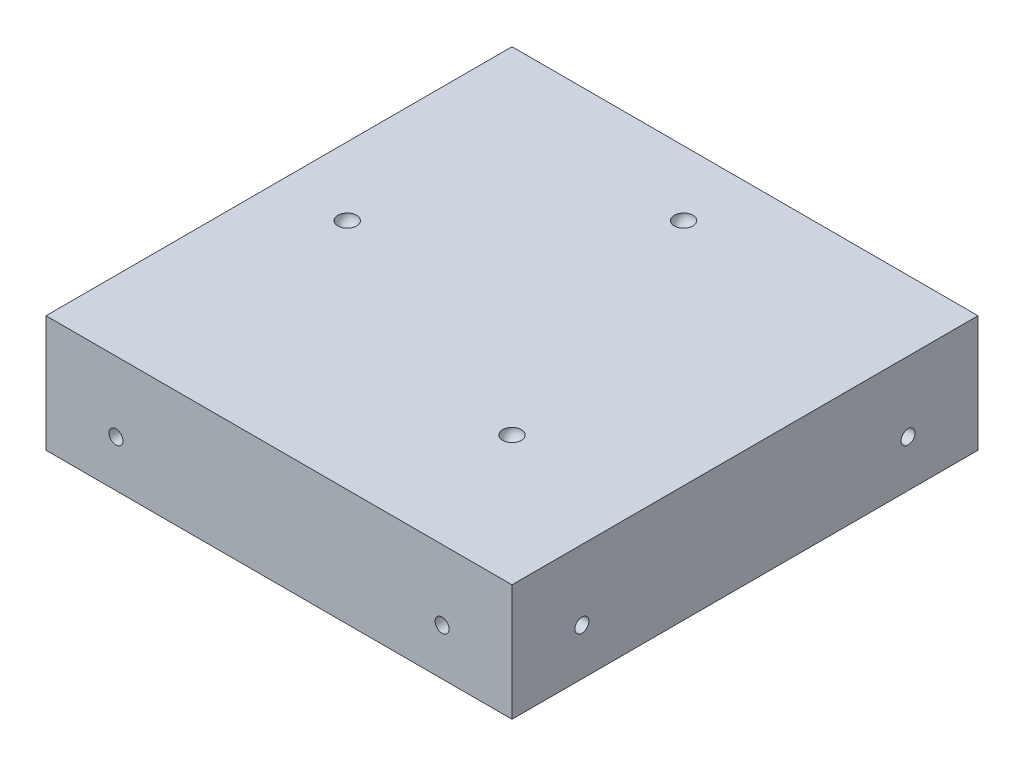
ISO-10303-21;
HEADER;
FILE_DESCRIPTION(('STEP AP214'),'2;1');
FILE_NAME('part.step','',(''),(''),'','','');
FILE_SCHEMA(('AUTOMOTIVE_DESIGN { 1 0 10303 214 1 1 1 1 }'));
ENDSEC;
DATA;
#1=APPLICATION_CONTEXT('core data for automotive mechanical design processes');
#2=APPLICATION_PROTOCOL_DEFINITION('international standard','automotive_design',2000,#1);
#3=PRODUCT_CONTEXT('',#1,'mechanical');
#4=PRODUCT('Part','Part','',(#3));
#5=PRODUCT_RELATED_PRODUCT_CATEGORY('part','',(#4));
#6=PRODUCT_DEFINITION_FORMATION('','',#4);
#7=PRODUCT_DEFINITION_CONTEXT('part definition',#1,'design');
#8=PRODUCT_DEFINITION('design','',#6,#7);
#9=PRODUCT_DEFINITION_SHAPE('','',#8);
#10=(LENGTH_UNIT() NAMED_UNIT(*) SI_UNIT(.MILLI.,.METRE.));
#11=(NAMED_UNIT(*) PLANE_ANGLE_UNIT() SI_UNIT($,.RADIAN.));
#12=(NAMED_UNIT(*) SI_UNIT($,.STERADIAN.) SOLID_ANGLE_UNIT());
#13=UNCERTAINTY_MEASURE_WITH_UNIT(LENGTH_MEASURE(1.E-05),#10,'distance_accuracy_value','');
#14=(GEOMETRIC_REPRESENTATION_CONTEXT(3) GLOBAL_UNCERTAINTY_ASSIGNED_CONTEXT((#13)) GLOBAL_UNIT_ASSIGNED_CONTEXT((#10,
#11,#12)) REPRESENTATION_CONTEXT('',''));
#15=CARTESIAN_POINT('',(0.,0.,0.));
#16=DIRECTION('',(0.,0.,1.));
#17=DIRECTION('',(1.,0.,0.));
#18=AXIS2_PLACEMENT_3D('',#15,#16,#17);
#19=CARTESIAN_POINT('',(50.,25.,-50.));
#20=DIRECTION('',(-1.,0.,0.));
#21=DIRECTION('',(0.,0.,1.));
#22=AXIS2_PLACEMENT_3D('',#19,#20,#21);
#23=PLANE('',#22);
#24=CARTESIAN_POINT('',(50.,10.,-35.));
#25=DIRECTION('',(1.,0.,0.));
#26=DIRECTION('',(0.,0.,-1.));
#27=AXIS2_PLACEMENT_3D('',#24,#25,#26);
#28=CIRCLE('',#27,1.5);
#29=CARTESIAN_POINT('',(50.,10.,-36.5));
#30=VERTEX_POINT('',#29);
#31=EDGE_CURVE('E140',#30,#30,#28,.T.);
#32=ORIENTED_EDGE('',*,*,#31,.F.);
#33=EDGE_LOOP('',(#32));
#34=FACE_BOUND('',#33,.T.);
#35=CARTESIAN_POINT('',(50.,10.,35.));
#36=DIRECTION('',(1.,0.,0.));
#37=DIRECTION('',(0.,0.,-1.));
#38=AXIS2_PLACEMENT_3D('',#35,#36,#37);
#39=CIRCLE('',#38,1.5);
#40=CARTESIAN_POINT('',(50.,10.,33.5));
#41=VERTEX_POINT('',#40);
#42=EDGE_CURVE('E134',#41,#41,#39,.T.);
#43=ORIENTED_EDGE('',*,*,#42,.F.);
#44=EDGE_LOOP('',(#43));
#45=FACE_BOUND('',#44,.T.);
#46=DIRECTION('',(0.,0.,-1.));
#47=VECTOR('',#46,1.);
#48=CARTESIAN_POINT('',(50.,0.,-50.));
#49=LINE('',#48,#47);
#50=CARTESIAN_POINT('',(50.,0.,50.));
#51=VERTEX_POINT('',#50);
#52=CARTESIAN_POINT('',(50.,0.,-50.));
#53=VERTEX_POINT('',#52);
#54=EDGE_CURVE('E101',#51,#53,#49,.T.);
#55=ORIENTED_EDGE('',*,*,#54,.T.);
#56=DIRECTION('',(0.,-1.,0.));
#57=VECTOR('',#56,1.);
#58=CARTESIAN_POINT('',(50.,25.,-50.));
#59=LINE('',#58,#57);
#60=CARTESIAN_POINT('',(50.,25.,-50.));
#61=VERTEX_POINT('',#60);
#62=EDGE_CURVE('E11',#61,#53,#59,.T.);
#63=ORIENTED_EDGE('',*,*,#62,.F.);
#64=DIRECTION('',(0.,0.,-1.));
#65=VECTOR('',#64,1.);
#66=CARTESIAN_POINT('',(50.,25.,-50.));
#67=LINE('',#66,#65);
#68=CARTESIAN_POINT('',(50.,25.,50.));
#69=VERTEX_POINT('',#68);
#70=EDGE_CURVE('E88',#69,#61,#67,.T.);
#71=ORIENTED_EDGE('',*,*,#70,.F.);
#72=DIRECTION('',(0.,-1.,0.));
#73=VECTOR('',#72,1.);
#74=CARTESIAN_POINT('',(50.,25.,50.));
#75=LINE('',#74,#73);
#76=EDGE_CURVE('E97',#69,#51,#75,.T.);
#77=ORIENTED_EDGE('',*,*,#76,.T.);
#78=EDGE_LOOP('',(#55,#63,#71,#77));
#79=FACE_BOUND('',#78,.T.);
#80=ADVANCED_FACE('F35',(#34,#45,#79),#23,.F.);
#81=CARTESIAN_POINT('',(-50.,25.,-50.));
#82=DIRECTION('',(0.,0.,1.));
#83=DIRECTION('',(1.,0.,0.));
#84=AXIS2_PLACEMENT_3D('',#81,#82,#83);
#85=PLANE('',#84);
#86=CARTESIAN_POINT('',(-35.,10.,-50.));
#87=DIRECTION('',(0.,0.,-1.));
#88=DIRECTION('',(-1.,0.,0.));
#89=AXIS2_PLACEMENT_3D('',#86,#87,#88);
#90=CIRCLE('',#89,1.5);
#91=CARTESIAN_POINT('',(-36.5,10.,-50.));
#92=VERTEX_POINT('',#91);
#93=EDGE_CURVE('E152',#92,#92,#90,.T.);
#94=ORIENTED_EDGE('',*,*,#93,.F.);
#95=EDGE_LOOP('',(#94));
#96=FACE_BOUND('',#95,.T.);
#97=CARTESIAN_POINT('',(35.,10.,-50.));
#98=DIRECTION('',(0.,0.,-1.));
#99=DIRECTION('',(-1.,0.,0.));
#100=AXIS2_PLACEMENT_3D('',#97,#98,#99);
#101=CIRCLE('',#100,1.5);
#102=CARTESIAN_POINT('',(33.5,10.,-50.));
#103=VERTEX_POINT('',#102);
#104=EDGE_CURVE('E146',#103,#103,#101,.T.);
#105=ORIENTED_EDGE('',*,*,#104,.F.);
#106=EDGE_LOOP('',(#105));
#107=FACE_BOUND('',#106,.T.);
#108=DIRECTION('',(-1.,0.,0.));
#109=VECTOR('',#108,1.);
#110=CARTESIAN_POINT('',(-50.,0.,-50.));
#111=LINE('',#110,#109);
#112=CARTESIAN_POINT('',(-50.,0.,-50.));
#113=VERTEX_POINT('',#112);
#114=EDGE_CURVE('E92',#53,#113,#111,.T.);
#115=ORIENTED_EDGE('',*,*,#114,.T.);
#116=DIRECTION('',(0.,-1.,0.));
#117=VECTOR('',#116,1.);
#118=CARTESIAN_POINT('',(-50.,25.,-50.));
#119=LINE('',#118,#117);
#120=CARTESIAN_POINT('',(-50.,25.,-50.));
#121=VERTEX_POINT('',#120);
#122=EDGE_CURVE('E44',#121,#113,#119,.T.);
#123=ORIENTED_EDGE('',*,*,#122,.F.);
#124=DIRECTION('',(-1.,0.,0.));
#125=VECTOR('',#124,1.);
#126=CARTESIAN_POINT('',(-50.,25.,-50.));
#127=LINE('',#126,#125);
#128=EDGE_CURVE('E83',#61,#121,#127,.T.);
#129=ORIENTED_EDGE('',*,*,#128,.F.);
#130=ORIENTED_EDGE('',*,*,#62,.T.);
#131=EDGE_LOOP('',(#115,#123,#129,#130));
#132=FACE_BOUND('',#131,.T.);
#133=ADVANCED_FACE('F91',(#96,#107,#132),#85,.F.);
#134=CARTESIAN_POINT('',(-50.,25.,-50.));
#135=DIRECTION('',(1.,0.,0.));
#136=DIRECTION('',(0.,0.,-1.));
#137=AXIS2_PLACEMENT_3D('',#134,#135,#136);
#138=PLANE('',#137);
#139=CARTESIAN_POINT('',(-50.,10.,35.));
#140=DIRECTION('',(-1.,0.,0.));
#141=DIRECTION('',(0.,0.,1.));
#142=AXIS2_PLACEMENT_3D('',#139,#140,#141);
#143=CIRCLE('',#142,1.5);
#144=CARTESIAN_POINT('',(-50.,10.,36.5));
#145=VERTEX_POINT('',#144);
#146=EDGE_CURVE('E164',#145,#145,#143,.T.);
#147=ORIENTED_EDGE('',*,*,#146,.F.);
#148=EDGE_LOOP('',(#147));
#149=FACE_BOUND('',#148,.T.);
#150=CARTESIAN_POINT('',(-50.,10.,-35.));
#151=DIRECTION('',(-1.,0.,0.));
#152=DIRECTION('',(0.,0.,1.));
#153=AXIS2_PLACEMENT_3D('',#150,#151,#152);
#154=CIRCLE('',#153,1.5);
#155=CARTESIAN_POINT('',(-50.,10.,-33.5));
#156=VERTEX_POINT('',#155);
#157=EDGE_CURVE('E158',#156,#156,#154,.T.);
#158=ORIENTED_EDGE('',*,*,#157,.F.);
#159=EDGE_LOOP('',(#158));
#160=FACE_BOUND('',#159,.T.);
#161=DIRECTION('',(0.,0.,1.));
#162=VECTOR('',#161,1.);
#163=CARTESIAN_POINT('',(-50.,0.,-50.));
#164=LINE('',#163,#162);
#165=CARTESIAN_POINT('',(-50.,0.,50.));
#166=VERTEX_POINT('',#165);
#167=EDGE_CURVE('E70',#113,#166,#164,.T.);
#168=ORIENTED_EDGE('',*,*,#167,.T.);
#169=DIRECTION('',(0.,-1.,0.));
#170=VECTOR('',#169,1.);
#171=CARTESIAN_POINT('',(-50.,25.,50.));
#172=LINE('',#171,#170);
#173=CARTESIAN_POINT('',(-50.,25.,50.));
#174=VERTEX_POINT('',#173);
#175=EDGE_CURVE('E93',#174,#166,#172,.T.);
#176=ORIENTED_EDGE('',*,*,#175,.F.);
#177=DIRECTION('',(0.,0.,1.));
#178=VECTOR('',#177,1.);
#179=CARTESIAN_POINT('',(-50.,25.,-50.));
#180=LINE('',#179,#178);
#181=EDGE_CURVE('E86',#121,#174,#180,.T.);
#182=ORIENTED_EDGE('',*,*,#181,.F.);
#183=ORIENTED_EDGE('',*,*,#122,.T.);
#184=EDGE_LOOP('',(#168,#176,#182,#183));
#185=FACE_BOUND('',#184,.T.);
#186=ADVANCED_FACE('F95',(#149,#160,#185),#138,.F.);
#187=CARTESIAN_POINT('',(-50.,25.,50.));
#188=DIRECTION('',(0.,0.,-1.));
#189=DIRECTION('',(-1.,0.,0.));
#190=AXIS2_PLACEMENT_3D('',#187,#188,#189);
#191=PLANE('',#190);
#192=CARTESIAN_POINT('',(35.,10.,50.));
#193=DIRECTION('',(0.,0.,1.));
#194=DIRECTION('',(1.,0.,0.));
#195=AXIS2_PLACEMENT_3D('',#192,#193,#194);
#196=CIRCLE('',#195,1.5);
#197=CARTESIAN_POINT('',(36.5,10.,50.));
#198=VERTEX_POINT('',#197);
#199=EDGE_CURVE('E128',#198,#198,#196,.T.);
#200=ORIENTED_EDGE('',*,*,#199,.F.);
#201=EDGE_LOOP('',(#200));
#202=FACE_BOUND('',#201,.T.);
#203=CARTESIAN_POINT('',(-35.,10.,50.));
#204=DIRECTION('',(0.,0.,1.));
#205=DIRECTION('',(1.,0.,0.));
#206=AXIS2_PLACEMENT_3D('',#203,#204,#205);
#207=CIRCLE('',#206,1.5);
#208=CARTESIAN_POINT('',(-33.5,10.,50.));
#209=VERTEX_POINT('',#208);
#210=EDGE_CURVE('E120',#209,#209,#207,.T.);
#211=ORIENTED_EDGE('',*,*,#210,.F.);
#212=EDGE_LOOP('',(#211));
#213=FACE_BOUND('',#212,.T.);
#214=DIRECTION('',(1.,0.,0.));
#215=VECTOR('',#214,1.);
#216=CARTESIAN_POINT('',(-50.,0.,50.));
#217=LINE('',#216,#215);
#218=EDGE_CURVE('E76',#166,#51,#217,.T.);
#219=ORIENTED_EDGE('',*,*,#218,.T.);
#220=ORIENTED_EDGE('',*,*,#76,.F.);
#221=DIRECTION('',(1.,0.,0.));
#222=VECTOR('',#221,1.);
#223=CARTESIAN_POINT('',(-50.,25.,50.));
#224=LINE('',#223,#222);
#225=EDGE_CURVE('E53',#174,#69,#224,.T.);
#226=ORIENTED_EDGE('',*,*,#225,.F.);
#227=ORIENTED_EDGE('',*,*,#175,.T.);
#228=EDGE_LOOP('',(#219,#220,#226,#227));
#229=FACE_BOUND('',#228,.T.);
#230=ADVANCED_FACE('F181',(#202,#213,#229),#191,.F.);
#231=CARTESIAN_POINT('',(0.,25.,0.));
#232=DIRECTION('',(0.,1.,0.));
#233=DIRECTION('',(0.,0.,1.));
#234=AXIS2_PLACEMENT_3D('',#231,#232,#233);
#235=PLANE('',#234);
#236=CARTESIAN_POINT('',(22.1678315681881,25.,22.1678315681881));
#237=DIRECTION('',(0.,1.,0.));
#238=DIRECTION('',(0.,0.,1.));
#239=AXIS2_PLACEMENT_3D('',#236,#237,#238);
#240=CIRCLE('',#239,2.);
#241=CARTESIAN_POINT('',(22.1678315681881,25.,24.1678315681881));
#242=VERTEX_POINT('',#241);
#243=EDGE_CURVE('E38',#242,#242,#240,.F.);
#244=ORIENTED_EDGE('',*,*,#243,.T.);
#245=EDGE_LOOP('',(#244));
#246=FACE_BOUND('',#245,.T.);
#247=CARTESIAN_POINT('',(0.73373407162599,25.,-36.0890731309555));
#248=DIRECTION('',(0.,1.,0.));
#249=DIRECTION('',(0.,0.,1.));
#250=AXIS2_PLACEMENT_3D('',#247,#248,#249);
#251=CIRCLE('',#250,2.);
#252=CARTESIAN_POINT('',(0.73373407162599,25.,-34.0890731309555));
#253=VERTEX_POINT('',#252);
#254=EDGE_CURVE('E111',#253,#253,#251,.T.);
#255=ORIENTED_EDGE('',*,*,#254,.F.);
#256=EDGE_LOOP('',(#255));
#257=FACE_BOUND('',#256,.T.);
#258=CARTESIAN_POINT('',(-35.3553390593274,25.,0.));
#259=DIRECTION('',(0.,1.,0.));
#260=DIRECTION('',(0.,0.,1.));
#261=AXIS2_PLACEMENT_3D('',#258,#259,#260);
#262=CIRCLE('',#261,2.);
#263=CARTESIAN_POINT('',(-35.3553390593274,25.,2.));
#264=VERTEX_POINT('',#263);
#265=EDGE_CURVE('E104',#264,#264,#262,.F.);
#266=ORIENTED_EDGE('',*,*,#265,.T.);
#267=EDGE_LOOP('',(#266));
#268=FACE_BOUND('',#267,.T.);
#269=ORIENTED_EDGE('',*,*,#70,.T.);
#270=ORIENTED_EDGE('',*,*,#128,.T.);
#271=ORIENTED_EDGE('',*,*,#181,.T.);
#272=ORIENTED_EDGE('',*,*,#225,.T.);
#273=EDGE_LOOP('',(#269,#270,#271,#272));
#274=FACE_BOUND('',#273,.T.);
#275=ADVANCED_FACE('F84',(#246,#257,#268,#274),#235,.T.);
#276=CARTESIAN_POINT('',(0.,0.,0.));
#277=DIRECTION('',(0.,1.,0.));
#278=DIRECTION('',(0.,0.,1.));
#279=AXIS2_PLACEMENT_3D('',#276,#277,#278);
#280=PLANE('',#279);
#281=ORIENTED_EDGE('',*,*,#54,.F.);
#282=ORIENTED_EDGE('',*,*,#218,.F.);
#283=ORIENTED_EDGE('',*,*,#167,.F.);
#284=ORIENTED_EDGE('',*,*,#114,.F.);
#285=EDGE_LOOP('',(#281,#282,#283,#284));
#286=FACE_BOUND('',#285,.T.);
#287=ADVANCED_FACE('F214',(#286),#280,.F.);
#288=CARTESIAN_POINT('',(-35.3553390593274,25.,0.));
#289=DIRECTION('',(-0.707106781186549,0.,-0.707106781186546));
#290=DIRECTION('',(-0.707106781186546,0.,0.707106781186549));
#291=AXIS2_PLACEMENT_3D('',#288,#289,#290);
#292=SPHERICAL_SURFACE('',#291,2.);
#293=CARTESIAN_POINT('',(-35.3553390593274,25.,0.));
#294=DIRECTION('',(0.,1.,0.));
#295=DIRECTION('',(0.,0.,1.));
#296=AXIS2_PLACEMENT_3D('',#293,#294,#295);
#297=SPHERICAL_SURFACE('',#296,2.);
#298=ORIENTED_EDGE('',*,*,#265,.F.);
#299=EDGE_LOOP('',(#298));
#300=FACE_BOUND('',#299,.T.);
#301=ADVANCED_FACE('F216',(#300),#297,.F.);
#302=CARTESIAN_POINT('',(0.73373407162599,25.,-36.0890731309555));
#303=DIRECTION('',(0.707106781186548,0.,0.707106781186547));
#304=DIRECTION('',(0.707106781186547,0.,-0.707106781186548));
#305=AXIS2_PLACEMENT_3D('',#302,#303,#304);
#306=SPHERICAL_SURFACE('',#305,2.);
#307=CARTESIAN_POINT('',(0.73373407162599,25.,-36.0890731309555));
#308=DIRECTION('',(0.,1.,0.));
#309=DIRECTION('',(0.,0.,1.));
#310=AXIS2_PLACEMENT_3D('',#307,#308,#309);
#311=SPHERICAL_SURFACE('',#310,2.);
#312=ORIENTED_EDGE('',*,*,#254,.T.);
#313=EDGE_LOOP('',(#312));
#314=FACE_BOUND('',#313,.T.);
#315=ADVANCED_FACE('F222',(#314),#311,.F.);
#316=CARTESIAN_POINT('',(22.1678315681881,25.,22.1678315681881));
#317=DIRECTION('',(-0.707106781186548,0.,-0.707106781186548));
#318=DIRECTION('',(0.707106781186548,0.,-0.707106781186548));
#319=AXIS2_PLACEMENT_3D('',#316,#317,#318);
#320=SPHERICAL_SURFACE('',#319,2.);
#321=CARTESIAN_POINT('',(22.1678315681881,25.,22.1678315681881));
#322=DIRECTION('',(0.,1.,0.));
#323=DIRECTION('',(0.,0.,1.));
#324=AXIS2_PLACEMENT_3D('',#321,#322,#323);
#325=SPHERICAL_SURFACE('',#324,2.);
#326=ORIENTED_EDGE('',*,*,#243,.F.);
#327=EDGE_LOOP('',(#326));
#328=FACE_BOUND('',#327,.T.);
#329=ADVANCED_FACE('F241',(#328),#325,.F.);
#330=CARTESIAN_POINT('',(-35.,10.,45.));
#331=DIRECTION('',(0.,0.,1.));
#332=DIRECTION('',(1.,0.,0.));
#333=AXIS2_PLACEMENT_3D('',#330,#331,#332);
#334=CYLINDRICAL_SURFACE('',#333,1.5);
#335=CARTESIAN_POINT('',(-35.,10.,45.));
#336=DIRECTION('',(0.,0.,1.));
#337=DIRECTION('',(1.,0.,0.));
#338=AXIS2_PLACEMENT_3D('',#335,#336,#337);
#339=CIRCLE('',#338,1.5);
#340=CARTESIAN_POINT('',(-33.5,10.,45.));
#341=VERTEX_POINT('',#340);
#342=EDGE_CURVE('E116',#341,#341,#339,.T.);
#343=ORIENTED_EDGE('',*,*,#342,.F.);
#344=EDGE_LOOP('',(#343));
#345=FACE_BOUND('',#344,.T.);
#346=ORIENTED_EDGE('',*,*,#210,.T.);
#347=EDGE_LOOP('',(#346));
#348=FACE_BOUND('',#347,.T.);
#349=ADVANCED_FACE('F238',(#345,#348),#334,.F.);
#350=CARTESIAN_POINT('',(-35.,10.,45.));
#351=DIRECTION('',(0.,0.,1.));
#352=DIRECTION('',(1.,0.,0.));
#353=AXIS2_PLACEMENT_3D('',#350,#351,#352);
#354=PLANE('',#353);
#355=ORIENTED_EDGE('',*,*,#342,.T.);
#356=EDGE_LOOP('',(#355));
#357=FACE_BOUND('',#356,.T.);
#358=ADVANCED_FACE('F240',(#357),#354,.T.);
#359=CARTESIAN_POINT('',(35.,10.,45.));
#360=DIRECTION('',(0.,0.,1.));
#361=DIRECTION('',(1.,0.,0.));
#362=AXIS2_PLACEMENT_3D('',#359,#360,#361);
#363=CYLINDRICAL_SURFACE('',#362,1.5);
#364=CARTESIAN_POINT('',(35.,10.,45.));
#365=DIRECTION('',(0.,0.,1.));
#366=DIRECTION('',(1.,0.,0.));
#367=AXIS2_PLACEMENT_3D('',#364,#365,#366);
#368=CIRCLE('',#367,1.5);
#369=CARTESIAN_POINT('',(36.5,10.,45.));
#370=VERTEX_POINT('',#369);
#371=EDGE_CURVE('E125',#370,#370,#368,.T.);
#372=ORIENTED_EDGE('',*,*,#371,.F.);
#373=EDGE_LOOP('',(#372));
#374=FACE_BOUND('',#373,.T.);
#375=ORIENTED_EDGE('',*,*,#199,.T.);
#376=EDGE_LOOP('',(#375));
#377=FACE_BOUND('',#376,.T.);
#378=ADVANCED_FACE('F247',(#374,#377),#363,.F.);
#379=CARTESIAN_POINT('',(35.,10.,45.));
#380=DIRECTION('',(0.,0.,1.));
#381=DIRECTION('',(1.,0.,0.));
#382=AXIS2_PLACEMENT_3D('',#379,#380,#381);
#383=PLANE('',#382);
#384=ORIENTED_EDGE('',*,*,#371,.T.);
#385=EDGE_LOOP('',(#384));
#386=FACE_BOUND('',#385,.T.);
#387=ADVANCED_FACE('F373',(#386),#383,.T.);
#388=CARTESIAN_POINT('',(45.,10.,35.));
#389=DIRECTION('',(1.,0.,0.));
#390=DIRECTION('',(0.,0.,-1.));
#391=AXIS2_PLACEMENT_3D('',#388,#389,#390);
#392=CYLINDRICAL_SURFACE('',#391,1.5);
#393=CARTESIAN_POINT('',(45.,10.,35.));
#394=DIRECTION('',(1.,0.,0.));
#395=DIRECTION('',(0.,0.,-1.));
#396=AXIS2_PLACEMENT_3D('',#393,#394,#395);
#397=CIRCLE('',#396,1.5);
#398=CARTESIAN_POINT('',(45.,10.,33.5));
#399=VERTEX_POINT('',#398);
#400=EDGE_CURVE('E131',#399,#399,#397,.T.);
#401=ORIENTED_EDGE('',*,*,#400,.F.);
#402=EDGE_LOOP('',(#401));
#403=FACE_BOUND('',#402,.T.);
#404=ORIENTED_EDGE('',*,*,#42,.T.);
#405=EDGE_LOOP('',(#404));
#406=FACE_BOUND('',#405,.T.);
#407=ADVANCED_FACE('F369',(#403,#406),#392,.F.);
#408=CARTESIAN_POINT('',(45.,10.,35.));
#409=DIRECTION('',(1.,0.,0.));
#410=DIRECTION('',(0.,0.,-1.));
#411=AXIS2_PLACEMENT_3D('',#408,#409,#410);
#412=PLANE('',#411);
#413=ORIENTED_EDGE('',*,*,#400,.T.);
#414=EDGE_LOOP('',(#413));
#415=FACE_BOUND('',#414,.T.);
#416=ADVANCED_FACE('F365',(#415),#412,.T.);
#417=CARTESIAN_POINT('',(45.,10.,-35.));
#418=DIRECTION('',(1.,0.,0.));
#419=DIRECTION('',(0.,0.,-1.));
#420=AXIS2_PLACEMENT_3D('',#417,#418,#419);
#421=CYLINDRICAL_SURFACE('',#420,1.5);
#422=CARTESIAN_POINT('',(45.,10.,-35.));
#423=DIRECTION('',(1.,0.,0.));
#424=DIRECTION('',(0.,0.,-1.));
#425=AXIS2_PLACEMENT_3D('',#422,#423,#424);
#426=CIRCLE('',#425,1.5);
#427=CARTESIAN_POINT('',(45.,10.,-36.5));
#428=VERTEX_POINT('',#427);
#429=EDGE_CURVE('E137',#428,#428,#426,.T.);
#430=ORIENTED_EDGE('',*,*,#429,.F.);
#431=EDGE_LOOP('',(#430));
#432=FACE_BOUND('',#431,.T.);
#433=ORIENTED_EDGE('',*,*,#31,.T.);
#434=EDGE_LOOP('',(#433));
#435=FACE_BOUND('',#434,.T.);
#436=ADVANCED_FACE('F361',(#432,#435),#421,.F.);
#437=CARTESIAN_POINT('',(45.,10.,-35.));
#438=DIRECTION('',(1.,0.,0.));
#439=DIRECTION('',(0.,0.,-1.));
#440=AXIS2_PLACEMENT_3D('',#437,#438,#439);
#441=PLANE('',#440);
#442=ORIENTED_EDGE('',*,*,#429,.T.);
#443=EDGE_LOOP('',(#442));
#444=FACE_BOUND('',#443,.T.);
#445=ADVANCED_FACE('F295',(#444),#441,.T.);
#446=CARTESIAN_POINT('',(35.,10.,-45.));
#447=DIRECTION('',(0.,0.,-1.));
#448=DIRECTION('',(-1.,0.,0.));
#449=AXIS2_PLACEMENT_3D('',#446,#447,#448);
#450=CYLINDRICAL_SURFACE('',#449,1.5);
#451=CARTESIAN_POINT('',(35.,10.,-45.));
#452=DIRECTION('',(0.,0.,-1.));
#453=DIRECTION('',(-1.,0.,0.));
#454=AXIS2_PLACEMENT_3D('',#451,#452,#453);
#455=CIRCLE('',#454,1.5);
#456=CARTESIAN_POINT('',(33.5,10.,-45.));
#457=VERTEX_POINT('',#456);
#458=EDGE_CURVE('E143',#457,#457,#455,.T.);
#459=ORIENTED_EDGE('',*,*,#458,.F.);
#460=EDGE_LOOP('',(#459));
#461=FACE_BOUND('',#460,.T.);
#462=ORIENTED_EDGE('',*,*,#104,.T.);
#463=EDGE_LOOP('',(#462));
#464=FACE_BOUND('',#463,.T.);
#465=ADVANCED_FACE('F300',(#461,#464),#450,.F.);
#466=CARTESIAN_POINT('',(35.,10.,-45.));
#467=DIRECTION('',(0.,0.,-1.));
#468=DIRECTION('',(-1.,0.,0.));
#469=AXIS2_PLACEMENT_3D('',#466,#467,#468);
#470=PLANE('',#469);
#471=ORIENTED_EDGE('',*,*,#458,.T.);
#472=EDGE_LOOP('',(#471));
#473=FACE_BOUND('',#472,.T.);
#474=ADVANCED_FACE('F305',(#473),#470,.T.);
#475=CARTESIAN_POINT('',(-35.,10.,-45.));
#476=DIRECTION('',(0.,0.,-1.));
#477=DIRECTION('',(-1.,0.,0.));
#478=AXIS2_PLACEMENT_3D('',#475,#476,#477);
#479=CYLINDRICAL_SURFACE('',#478,1.5);
#480=CARTESIAN_POINT('',(-35.,10.,-45.));
#481=DIRECTION('',(0.,0.,-1.));
#482=DIRECTION('',(-1.,0.,0.));
#483=AXIS2_PLACEMENT_3D('',#480,#481,#482);
#484=CIRCLE('',#483,1.5);
#485=CARTESIAN_POINT('',(-36.5,10.,-45.));
#486=VERTEX_POINT('',#485);
#487=EDGE_CURVE('E149',#486,#486,#484,.T.);
#488=ORIENTED_EDGE('',*,*,#487,.F.);
#489=EDGE_LOOP('',(#488));
#490=FACE_BOUND('',#489,.T.);
#491=ORIENTED_EDGE('',*,*,#93,.T.);
#492=EDGE_LOOP('',(#491));
#493=FACE_BOUND('',#492,.T.);
#494=ADVANCED_FACE('F196',(#490,#493),#479,.F.);
#495=CARTESIAN_POINT('',(-35.,10.,-45.));
#496=DIRECTION('',(0.,0.,-1.));
#497=DIRECTION('',(-1.,0.,0.));
#498=AXIS2_PLACEMENT_3D('',#495,#496,#497);
#499=PLANE('',#498);
#500=ORIENTED_EDGE('',*,*,#487,.T.);
#501=EDGE_LOOP('',(#500));
#502=FACE_BOUND('',#501,.T.);
#503=ADVANCED_FACE('F187',(#502),#499,.T.);
#504=CARTESIAN_POINT('',(-45.,10.,-35.));
#505=DIRECTION('',(-1.,0.,0.));
#506=DIRECTION('',(0.,0.,1.));
#507=AXIS2_PLACEMENT_3D('',#504,#505,#506);
#508=CYLINDRICAL_SURFACE('',#507,1.5);
#509=CARTESIAN_POINT('',(-45.,10.,-35.));
#510=DIRECTION('',(-1.,0.,0.));
#511=DIRECTION('',(0.,0.,1.));
#512=AXIS2_PLACEMENT_3D('',#509,#510,#511);
#513=CIRCLE('',#512,1.5);
#514=CARTESIAN_POINT('',(-45.,10.,-33.5));
#515=VERTEX_POINT('',#514);
#516=EDGE_CURVE('E155',#515,#515,#513,.T.);
#517=ORIENTED_EDGE('',*,*,#516,.F.);
#518=EDGE_LOOP('',(#517));
#519=FACE_BOUND('',#518,.T.);
#520=ORIENTED_EDGE('',*,*,#157,.T.);
#521=EDGE_LOOP('',(#520));
#522=FACE_BOUND('',#521,.T.);
#523=ADVANCED_FACE('F185',(#519,#522),#508,.F.);
#524=CARTESIAN_POINT('',(-45.,10.,-35.));
#525=DIRECTION('',(-1.,0.,0.));
#526=DIRECTION('',(0.,0.,1.));
#527=AXIS2_PLACEMENT_3D('',#524,#525,#526);
#528=PLANE('',#527);
#529=ORIENTED_EDGE('',*,*,#516,.T.);
#530=EDGE_LOOP('',(#529));
#531=FACE_BOUND('',#530,.T.);
#532=ADVANCED_FACE('F175',(#531),#528,.T.);
#533=CARTESIAN_POINT('',(-45.,10.,35.));
#534=DIRECTION('',(-1.,0.,0.));
#535=DIRECTION('',(0.,0.,1.));
#536=AXIS2_PLACEMENT_3D('',#533,#534,#535);
#537=CYLINDRICAL_SURFACE('',#536,1.5);
#538=CARTESIAN_POINT('',(-45.,10.,35.));
#539=DIRECTION('',(-1.,0.,0.));
#540=DIRECTION('',(0.,0.,1.));
#541=AXIS2_PLACEMENT_3D('',#538,#539,#540);
#542=CIRCLE('',#541,1.5);
#543=CARTESIAN_POINT('',(-45.,10.,36.5));
#544=VERTEX_POINT('',#543);
#545=EDGE_CURVE('E161',#544,#544,#542,.T.);
#546=ORIENTED_EDGE('',*,*,#545,.F.);
#547=EDGE_LOOP('',(#546));
#548=FACE_BOUND('',#547,.T.);
#549=ORIENTED_EDGE('',*,*,#146,.T.);
#550=EDGE_LOOP('',(#549));
#551=FACE_BOUND('',#550,.T.);
#552=ADVANCED_FACE('F172',(#548,#551),#537,.F.);
#553=CARTESIAN_POINT('',(-45.,10.,35.));
#554=DIRECTION('',(-1.,0.,0.));
#555=DIRECTION('',(0.,0.,1.));
#556=AXIS2_PLACEMENT_3D('',#553,#554,#555);
#557=PLANE('',#556);
#558=ORIENTED_EDGE('',*,*,#545,.T.);
#559=EDGE_LOOP('',(#558));
#560=FACE_BOUND('',#559,.T.);
#561=ADVANCED_FACE('F170',(#560),#557,.T.);
#562=CLOSED_SHELL('',(#80,#133,#186,#230,#275,#287,#301,#315,#329,#349,#358,#378,#387,#407,#416,
#436,#445,#465,#474,#494,#503,#523,#532,#552,#561));
#563=MANIFOLD_SOLID_BREP('B2',#562);
#564=ADVANCED_BREP_SHAPE_REPRESENTATION('',(#18,#563),#14);
#565=SHAPE_DEFINITION_REPRESENTATION(#9,#564);
ENDSEC;
END-ISO-10303-21;
